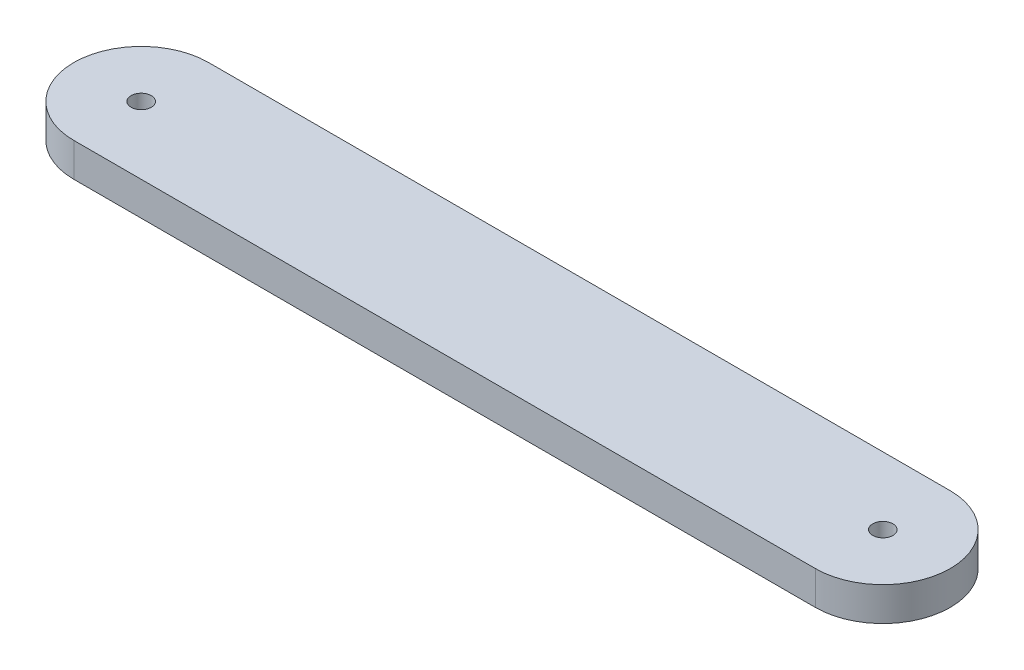
ISO-10303-21;
HEADER;
FILE_DESCRIPTION(('STEP AP214'),'2;1');
FILE_NAME('part.step','',(''),(''),'','','');
FILE_SCHEMA(('AUTOMOTIVE_DESIGN { 1 0 10303 214 1 1 1 1 }'));
ENDSEC;
DATA;
#1=APPLICATION_CONTEXT('core data for automotive mechanical design processes');
#2=APPLICATION_PROTOCOL_DEFINITION('international standard','automotive_design',2000,#1);
#3=PRODUCT_CONTEXT('',#1,'mechanical');
#4=PRODUCT('Part','Part','',(#3));
#5=PRODUCT_RELATED_PRODUCT_CATEGORY('part','',(#4));
#6=PRODUCT_DEFINITION_FORMATION('','',#4);
#7=PRODUCT_DEFINITION_CONTEXT('part definition',#1,'design');
#8=PRODUCT_DEFINITION('design','',#6,#7);
#9=PRODUCT_DEFINITION_SHAPE('','',#8);
#10=(LENGTH_UNIT() NAMED_UNIT(*) SI_UNIT(.MILLI.,.METRE.));
#11=(NAMED_UNIT(*) PLANE_ANGLE_UNIT() SI_UNIT($,.RADIAN.));
#12=(NAMED_UNIT(*) SI_UNIT($,.STERADIAN.) SOLID_ANGLE_UNIT());
#13=UNCERTAINTY_MEASURE_WITH_UNIT(LENGTH_MEASURE(1.E-05),#10,'distance_accuracy_value','');
#14=(GEOMETRIC_REPRESENTATION_CONTEXT(3) GLOBAL_UNCERTAINTY_ASSIGNED_CONTEXT((#13)) GLOBAL_UNIT_ASSIGNED_CONTEXT((#10,
#11,#12)) REPRESENTATION_CONTEXT('',''));
#15=CARTESIAN_POINT('',(0.,0.,0.));
#16=DIRECTION('',(0.,0.,1.));
#17=DIRECTION('',(1.,0.,0.));
#18=AXIS2_PLACEMENT_3D('',#15,#16,#17);
#19=CARTESIAN_POINT('',(220.,10.,0.));
#20=DIRECTION('',(0.,1.,0.));
#21=DIRECTION('',(0.,0.,1.));
#22=AXIS2_PLACEMENT_3D('',#19,#20,#21);
#23=PLANE('',#22);
#24=CARTESIAN_POINT('',(0.,10.,0.));
#25=DIRECTION('',(0.,1.,0.));
#26=DIRECTION('',(0.,0.,1.));
#27=AXIS2_PLACEMENT_3D('',#24,#25,#26);
#28=CIRCLE('',#27,3.);
#29=CARTESIAN_POINT('',(0.,10.,3.));
#30=VERTEX_POINT('',#29);
#31=EDGE_CURVE('E100',#30,#30,#28,.T.);
#32=ORIENTED_EDGE('',*,*,#31,.F.);
#33=EDGE_LOOP('',(#32));
#34=FACE_BOUND('',#33,.T.);
#35=CARTESIAN_POINT('',(220.,10.,0.));
#36=DIRECTION('',(0.,1.,0.));
#37=DIRECTION('',(0.,0.,1.));
#38=AXIS2_PLACEMENT_3D('',#35,#36,#37);
#39=CIRCLE('',#38,20.);
#40=CARTESIAN_POINT('',(220.,10.,20.));
#41=VERTEX_POINT('',#40);
#42=CARTESIAN_POINT('',(220.,10.,-20.));
#43=VERTEX_POINT('',#42);
#44=EDGE_CURVE('E85',#41,#43,#39,.T.);
#45=ORIENTED_EDGE('',*,*,#44,.T.);
#46=DIRECTION('',(-1.,0.,0.));
#47=VECTOR('',#46,1.);
#48=CARTESIAN_POINT('',(220.,10.,-20.));
#49=LINE('',#48,#47);
#50=CARTESIAN_POINT('',(0.,10.,-20.));
#51=VERTEX_POINT('',#50);
#52=EDGE_CURVE('E80',#43,#51,#49,.T.);
#53=ORIENTED_EDGE('',*,*,#52,.T.);
#54=CARTESIAN_POINT('',(0.,10.,0.));
#55=DIRECTION('',(0.,1.,0.));
#56=DIRECTION('',(0.,0.,1.));
#57=AXIS2_PLACEMENT_3D('',#54,#55,#56);
#58=CIRCLE('',#57,20.);
#59=CARTESIAN_POINT('',(0.,10.,20.));
#60=VERTEX_POINT('',#59);
#61=EDGE_CURVE('E83',#51,#60,#58,.T.);
#62=ORIENTED_EDGE('',*,*,#61,.T.);
#63=DIRECTION('',(1.,0.,0.));
#64=VECTOR('',#63,1.);
#65=CARTESIAN_POINT('',(0.,10.,20.));
#66=LINE('',#65,#64);
#67=EDGE_CURVE('E50',#60,#41,#66,.T.);
#68=ORIENTED_EDGE('',*,*,#67,.T.);
#69=EDGE_LOOP('',(#45,#53,#62,#68));
#70=FACE_BOUND('',#69,.T.);
#71=CARTESIAN_POINT('',(220.,10.,0.));
#72=DIRECTION('',(0.,1.,0.));
#73=DIRECTION('',(0.,0.,1.));
#74=AXIS2_PLACEMENT_3D('',#71,#72,#73);
#75=CIRCLE('',#74,2.99999999999999);
#76=CARTESIAN_POINT('',(220.,10.,2.99999999999999));
#77=VERTEX_POINT('',#76);
#78=EDGE_CURVE('E115',#77,#77,#75,.T.);
#79=ORIENTED_EDGE('',*,*,#78,.F.);
#80=EDGE_LOOP('',(#79));
#81=FACE_BOUND('',#80,.T.);
#82=ADVANCED_FACE('F33',(#34,#70,#81),#23,.T.);
#83=CARTESIAN_POINT('',(220.,0.,0.));
#84=DIRECTION('',(0.,1.,0.));
#85=DIRECTION('',(0.,0.,1.));
#86=AXIS2_PLACEMENT_3D('',#83,#84,#85);
#87=PLANE('',#86);
#88=CARTESIAN_POINT('',(220.,0.,0.));
#89=DIRECTION('',(0.,1.,0.));
#90=DIRECTION('',(0.,0.,1.));
#91=AXIS2_PLACEMENT_3D('',#88,#89,#90);
#92=CIRCLE('',#91,20.);
#93=CARTESIAN_POINT('',(220.,0.,20.));
#94=VERTEX_POINT('',#93);
#95=CARTESIAN_POINT('',(220.,0.,-20.));
#96=VERTEX_POINT('',#95);
#97=EDGE_CURVE('E97',#94,#96,#92,.T.);
#98=ORIENTED_EDGE('',*,*,#97,.F.);
#99=DIRECTION('',(1.,0.,0.));
#100=VECTOR('',#99,1.);
#101=CARTESIAN_POINT('',(0.,0.,20.));
#102=LINE('',#101,#100);
#103=CARTESIAN_POINT('',(0.,0.,20.));
#104=VERTEX_POINT('',#103);
#105=EDGE_CURVE('E73',#104,#94,#102,.T.);
#106=ORIENTED_EDGE('',*,*,#105,.F.);
#107=CARTESIAN_POINT('',(0.,0.,0.));
#108=DIRECTION('',(0.,1.,0.));
#109=DIRECTION('',(0.,0.,1.));
#110=AXIS2_PLACEMENT_3D('',#107,#108,#109);
#111=CIRCLE('',#110,20.);
#112=CARTESIAN_POINT('',(0.,0.,-20.));
#113=VERTEX_POINT('',#112);
#114=EDGE_CURVE('E67',#113,#104,#111,.T.);
#115=ORIENTED_EDGE('',*,*,#114,.F.);
#116=DIRECTION('',(-1.,0.,0.));
#117=VECTOR('',#116,1.);
#118=CARTESIAN_POINT('',(220.,0.,-20.));
#119=LINE('',#118,#117);
#120=EDGE_CURVE('E89',#96,#113,#119,.T.);
#121=ORIENTED_EDGE('',*,*,#120,.F.);
#122=EDGE_LOOP('',(#98,#106,#115,#121));
#123=FACE_BOUND('',#122,.T.);
#124=CARTESIAN_POINT('',(0.,0.,0.));
#125=DIRECTION('',(0.,1.,0.));
#126=DIRECTION('',(0.,0.,1.));
#127=AXIS2_PLACEMENT_3D('',#124,#125,#126);
#128=CIRCLE('',#127,3.);
#129=CARTESIAN_POINT('',(0.,0.,3.));
#130=VERTEX_POINT('',#129);
#131=EDGE_CURVE('E112',#130,#130,#128,.T.);
#132=ORIENTED_EDGE('',*,*,#131,.T.);
#133=EDGE_LOOP('',(#132));
#134=FACE_BOUND('',#133,.T.);
#135=CARTESIAN_POINT('',(220.,0.,0.));
#136=DIRECTION('',(0.,1.,0.));
#137=DIRECTION('',(0.,0.,1.));
#138=AXIS2_PLACEMENT_3D('',#135,#136,#137);
#139=CIRCLE('',#138,2.99999999999999);
#140=CARTESIAN_POINT('',(220.,0.,2.99999999999999));
#141=VERTEX_POINT('',#140);
#142=EDGE_CURVE('E118',#141,#141,#139,.T.);
#143=ORIENTED_EDGE('',*,*,#142,.T.);
#144=EDGE_LOOP('',(#143));
#145=FACE_BOUND('',#144,.T.);
#146=ADVANCED_FACE('F108',(#123,#134,#145),#87,.F.);
#147=CARTESIAN_POINT('',(220.,10.,0.));
#148=DIRECTION('',(0.,-1.,0.));
#149=DIRECTION('',(0.,0.,-1.));
#150=AXIS2_PLACEMENT_3D('',#147,#148,#149);
#151=CYLINDRICAL_SURFACE('',#150,20.);
#152=ORIENTED_EDGE('',*,*,#97,.T.);
#153=DIRECTION('',(0.,-1.,0.));
#154=VECTOR('',#153,1.);
#155=CARTESIAN_POINT('',(220.,10.,-20.));
#156=LINE('',#155,#154);
#157=EDGE_CURVE('E11',#43,#96,#156,.T.);
#158=ORIENTED_EDGE('',*,*,#157,.F.);
#159=ORIENTED_EDGE('',*,*,#44,.F.);
#160=DIRECTION('',(0.,-1.,0.));
#161=VECTOR('',#160,1.);
#162=CARTESIAN_POINT('',(220.,10.,20.));
#163=LINE('',#162,#161);
#164=EDGE_CURVE('E93',#41,#94,#163,.T.);
#165=ORIENTED_EDGE('',*,*,#164,.T.);
#166=EDGE_LOOP('',(#152,#158,#159,#165));
#167=FACE_BOUND('',#166,.T.);
#168=ADVANCED_FACE('F35',(#167),#151,.T.);
#169=CARTESIAN_POINT('',(220.,10.,-20.));
#170=DIRECTION('',(0.,0.,1.));
#171=DIRECTION('',(1.,0.,0.));
#172=AXIS2_PLACEMENT_3D('',#169,#170,#171);
#173=PLANE('',#172);
#174=ORIENTED_EDGE('',*,*,#120,.T.);
#175=DIRECTION('',(0.,-1.,0.));
#176=VECTOR('',#175,1.);
#177=CARTESIAN_POINT('',(0.,10.,-20.));
#178=LINE('',#177,#176);
#179=EDGE_CURVE('E42',#51,#113,#178,.T.);
#180=ORIENTED_EDGE('',*,*,#179,.F.);
#181=ORIENTED_EDGE('',*,*,#52,.F.);
#182=ORIENTED_EDGE('',*,*,#157,.T.);
#183=EDGE_LOOP('',(#174,#180,#181,#182));
#184=FACE_BOUND('',#183,.T.);
#185=ADVANCED_FACE('F88',(#184),#173,.F.);
#186=CARTESIAN_POINT('',(0.,10.,0.));
#187=DIRECTION('',(0.,-1.,0.));
#188=DIRECTION('',(0.,0.,-1.));
#189=AXIS2_PLACEMENT_3D('',#186,#187,#188);
#190=CYLINDRICAL_SURFACE('',#189,20.);
#191=ORIENTED_EDGE('',*,*,#114,.T.);
#192=DIRECTION('',(0.,-1.,0.));
#193=VECTOR('',#192,1.);
#194=CARTESIAN_POINT('',(0.,10.,20.));
#195=LINE('',#194,#193);
#196=EDGE_CURVE('E90',#60,#104,#195,.T.);
#197=ORIENTED_EDGE('',*,*,#196,.F.);
#198=ORIENTED_EDGE('',*,*,#61,.F.);
#199=ORIENTED_EDGE('',*,*,#179,.T.);
#200=EDGE_LOOP('',(#191,#197,#198,#199));
#201=FACE_BOUND('',#200,.T.);
#202=ADVANCED_FACE('F91',(#201),#190,.T.);
#203=CARTESIAN_POINT('',(0.,10.,20.));
#204=DIRECTION('',(0.,0.,-1.));
#205=DIRECTION('',(-1.,0.,0.));
#206=AXIS2_PLACEMENT_3D('',#203,#204,#205);
#207=PLANE('',#206);
#208=ORIENTED_EDGE('',*,*,#105,.T.);
#209=ORIENTED_EDGE('',*,*,#164,.F.);
#210=ORIENTED_EDGE('',*,*,#67,.F.);
#211=ORIENTED_EDGE('',*,*,#196,.T.);
#212=EDGE_LOOP('',(#208,#209,#210,#211));
#213=FACE_BOUND('',#212,.T.);
#214=ADVANCED_FACE('F105',(#213),#207,.F.);
#215=CARTESIAN_POINT('',(0.,10.,0.));
#216=DIRECTION('',(0.,-1.,0.));
#217=DIRECTION('',(0.,0.,-1.));
#218=AXIS2_PLACEMENT_3D('',#215,#216,#217);
#219=CYLINDRICAL_SURFACE('',#218,3.);
#220=ORIENTED_EDGE('',*,*,#31,.T.);
#221=EDGE_LOOP('',(#220));
#222=FACE_BOUND('',#221,.T.);
#223=ORIENTED_EDGE('',*,*,#131,.F.);
#224=EDGE_LOOP('',(#223));
#225=FACE_BOUND('',#224,.T.);
#226=ADVANCED_FACE('F135',(#222,#225),#219,.F.);
#227=CARTESIAN_POINT('',(220.,10.,0.));
#228=DIRECTION('',(0.,-1.,0.));
#229=DIRECTION('',(0.,0.,-1.));
#230=AXIS2_PLACEMENT_3D('',#227,#228,#229);
#231=CYLINDRICAL_SURFACE('',#230,2.99999999999999);
#232=ORIENTED_EDGE('',*,*,#78,.T.);
#233=EDGE_LOOP('',(#232));
#234=FACE_BOUND('',#233,.T.);
#235=ORIENTED_EDGE('',*,*,#142,.F.);
#236=EDGE_LOOP('',(#235));
#237=FACE_BOUND('',#236,.T.);
#238=ADVANCED_FACE('F124',(#234,#237),#231,.F.);
#239=CLOSED_SHELL('',(#82,#146,#168,#185,#202,#214,#226,#238));
#240=MANIFOLD_SOLID_BREP('B2',#239);
#241=ADVANCED_BREP_SHAPE_REPRESENTATION('',(#18,#240),#14);
#242=SHAPE_DEFINITION_REPRESENTATION(#9,#241);
ENDSEC;
END-ISO-10303-21;
